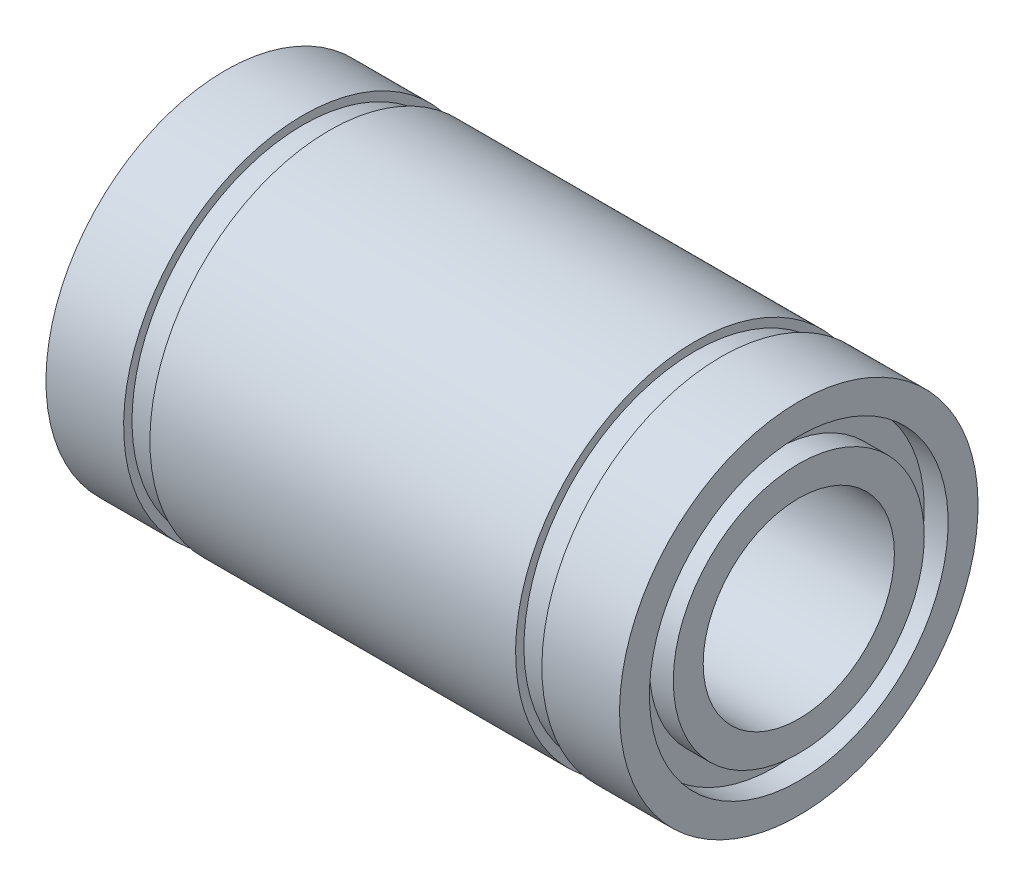
ISO-10303-21;
HEADER;
FILE_DESCRIPTION(('STEP AP214'),'2;1');
FILE_NAME('part.step','',(''),(''),'','','');
FILE_SCHEMA(('AUTOMOTIVE_DESIGN { 1 0 10303 214 1 1 1 1 }'));
ENDSEC;
DATA;
#1=APPLICATION_CONTEXT('core data for automotive mechanical design processes');
#2=APPLICATION_PROTOCOL_DEFINITION('international standard','automotive_design',2000,#1);
#3=PRODUCT_CONTEXT('',#1,'mechanical');
#4=PRODUCT('Part','Part','',(#3));
#5=PRODUCT_RELATED_PRODUCT_CATEGORY('part','',(#4));
#6=PRODUCT_DEFINITION_FORMATION('','',#4);
#7=PRODUCT_DEFINITION_CONTEXT('part definition',#1,'design');
#8=PRODUCT_DEFINITION('design','',#6,#7);
#9=PRODUCT_DEFINITION_SHAPE('','',#8);
#10=(LENGTH_UNIT() NAMED_UNIT(*) SI_UNIT(.MILLI.,.METRE.));
#11=(NAMED_UNIT(*) PLANE_ANGLE_UNIT() SI_UNIT($,.RADIAN.));
#12=(NAMED_UNIT(*) SI_UNIT($,.STERADIAN.) SOLID_ANGLE_UNIT());
#13=UNCERTAINTY_MEASURE_WITH_UNIT(LENGTH_MEASURE(1.E-05),#10,'distance_accuracy_value','');
#14=(GEOMETRIC_REPRESENTATION_CONTEXT(3) GLOBAL_UNCERTAINTY_ASSIGNED_CONTEXT((#13)) GLOBAL_UNIT_ASSIGNED_CONTEXT((#10,
#11,#12)) REPRESENTATION_CONTEXT('',''));
#15=CARTESIAN_POINT('',(0.,0.,0.));
#16=DIRECTION('',(0.,0.,1.));
#17=DIRECTION('',(1.,0.,0.));
#18=AXIS2_PLACEMENT_3D('',#15,#16,#17);
#19=CARTESIAN_POINT('',(-12.,6.25,0.));
#20=DIRECTION('',(-1.,0.,0.));
#21=DIRECTION('',(0.,-1.,0.));
#22=AXIS2_PLACEMENT_3D('',#19,#20,#21);
#23=PLANE('',#22);
#24=CARTESIAN_POINT('',(-12.,0.,0.));
#25=DIRECTION('',(1.,0.,0.));
#26=DIRECTION('',(0.,1.,0.));
#27=AXIS2_PLACEMENT_3D('',#24,#25,#26);
#28=CIRCLE('',#27,6.25);
#29=CARTESIAN_POINT('',(-12.,6.25,0.));
#30=VERTEX_POINT('',#29);
#31=EDGE_CURVE('E98',#30,#30,#28,.T.);
#32=ORIENTED_EDGE('',*,*,#31,.T.);
#33=EDGE_LOOP('',(#32));
#34=FACE_BOUND('',#33,.T.);
#35=CARTESIAN_POINT('',(-12.,0.,0.));
#36=DIRECTION('',(1.,0.,0.));
#37=DIRECTION('',(0.,1.,0.));
#38=AXIS2_PLACEMENT_3D('',#35,#36,#37);
#39=CIRCLE('',#38,7.5);
#40=CARTESIAN_POINT('',(-12.,7.5,0.));
#41=VERTEX_POINT('',#40);
#42=EDGE_CURVE('E10',#41,#41,#39,.T.);
#43=ORIENTED_EDGE('',*,*,#42,.F.);
#44=EDGE_LOOP('',(#43));
#45=FACE_BOUND('',#44,.T.);
#46=ADVANCED_FACE('F34',(#34,#45),#23,.T.);
#47=CARTESIAN_POINT('',(0.,0.,0.));
#48=DIRECTION('',(1.,0.,0.));
#49=DIRECTION('',(0.,1.,0.));
#50=AXIS2_PLACEMENT_3D('',#47,#48,#49);
#51=CYLINDRICAL_SURFACE('',#50,7.50000000000001);
#52=ORIENTED_EDGE('',*,*,#42,.T.);
#53=EDGE_LOOP('',(#52));
#54=FACE_BOUND('',#53,.T.);
#55=CARTESIAN_POINT('',(-8.75,0.,0.));
#56=DIRECTION('',(1.,0.,0.));
#57=DIRECTION('',(0.,1.,0.));
#58=AXIS2_PLACEMENT_3D('',#55,#56,#57);
#59=CIRCLE('',#58,7.50000000000001);
#60=CARTESIAN_POINT('',(-8.75,7.50000000000001,0.));
#61=VERTEX_POINT('',#60);
#62=EDGE_CURVE('E40',#61,#61,#59,.T.);
#63=ORIENTED_EDGE('',*,*,#62,.F.);
#64=EDGE_LOOP('',(#63));
#65=FACE_BOUND('',#64,.T.);
#66=ADVANCED_FACE('F116',(#54,#65),#51,.T.);
#67=CARTESIAN_POINT('',(-8.75,7.50000000000001,0.));
#68=DIRECTION('',(1.,0.,0.));
#69=DIRECTION('',(0.,1.,0.));
#70=AXIS2_PLACEMENT_3D('',#67,#68,#69);
#71=PLANE('',#70);
#72=ORIENTED_EDGE('',*,*,#62,.T.);
#73=EDGE_LOOP('',(#72));
#74=FACE_BOUND('',#73,.T.);
#75=CARTESIAN_POINT('',(-8.75,0.,0.));
#76=DIRECTION('',(1.,0.,0.));
#77=DIRECTION('',(0.,1.,0.));
#78=AXIS2_PLACEMENT_3D('',#75,#76,#77);
#79=CIRCLE('',#78,7.15);
#80=CARTESIAN_POINT('',(-8.75,7.15,0.));
#81=VERTEX_POINT('',#80);
#82=EDGE_CURVE('E44',#81,#81,#79,.T.);
#83=ORIENTED_EDGE('',*,*,#82,.F.);
#84=EDGE_LOOP('',(#83));
#85=FACE_BOUND('',#84,.T.);
#86=ADVANCED_FACE('F120',(#74,#85),#71,.T.);
#87=CARTESIAN_POINT('',(0.,0.,0.));
#88=DIRECTION('',(1.,0.,0.));
#89=DIRECTION('',(0.,1.,0.));
#90=AXIS2_PLACEMENT_3D('',#87,#88,#89);
#91=CYLINDRICAL_SURFACE('',#90,7.15);
#92=ORIENTED_EDGE('',*,*,#82,.T.);
#93=EDGE_LOOP('',(#92));
#94=FACE_BOUND('',#93,.T.);
#95=CARTESIAN_POINT('',(-7.65,0.,0.));
#96=DIRECTION('',(1.,0.,0.));
#97=DIRECTION('',(0.,1.,0.));
#98=AXIS2_PLACEMENT_3D('',#95,#96,#97);
#99=CIRCLE('',#98,7.15);
#100=CARTESIAN_POINT('',(-7.65,7.15,0.));
#101=VERTEX_POINT('',#100);
#102=EDGE_CURVE('E48',#101,#101,#99,.T.);
#103=ORIENTED_EDGE('',*,*,#102,.F.);
#104=EDGE_LOOP('',(#103));
#105=FACE_BOUND('',#104,.T.);
#106=ADVANCED_FACE('F124',(#94,#105),#91,.T.);
#107=CARTESIAN_POINT('',(-7.65,7.15,0.));
#108=DIRECTION('',(-1.,0.,0.));
#109=DIRECTION('',(0.,-1.,0.));
#110=AXIS2_PLACEMENT_3D('',#107,#108,#109);
#111=PLANE('',#110);
#112=ORIENTED_EDGE('',*,*,#102,.T.);
#113=EDGE_LOOP('',(#112));
#114=FACE_BOUND('',#113,.T.);
#115=CARTESIAN_POINT('',(-7.65,0.,0.));
#116=DIRECTION('',(1.,0.,0.));
#117=DIRECTION('',(0.,1.,0.));
#118=AXIS2_PLACEMENT_3D('',#115,#116,#117);
#119=CIRCLE('',#118,7.50000000000001);
#120=CARTESIAN_POINT('',(-7.65,7.50000000000001,0.));
#121=VERTEX_POINT('',#120);
#122=EDGE_CURVE('E53',#121,#121,#119,.T.);
#123=ORIENTED_EDGE('',*,*,#122,.F.);
#124=EDGE_LOOP('',(#123));
#125=FACE_BOUND('',#124,.T.);
#126=ADVANCED_FACE('F130',(#114,#125),#111,.T.);
#127=CARTESIAN_POINT('',(0.,0.,0.));
#128=DIRECTION('',(1.,0.,0.));
#129=DIRECTION('',(0.,1.,0.));
#130=AXIS2_PLACEMENT_3D('',#127,#128,#129);
#131=CYLINDRICAL_SURFACE('',#130,7.50000000000001);
#132=ORIENTED_EDGE('',*,*,#122,.T.);
#133=EDGE_LOOP('',(#132));
#134=FACE_BOUND('',#133,.T.);
#135=CARTESIAN_POINT('',(7.65,0.,0.));
#136=DIRECTION('',(1.,0.,0.));
#137=DIRECTION('',(0.,1.,0.));
#138=AXIS2_PLACEMENT_3D('',#135,#136,#137);
#139=CIRCLE('',#138,7.50000000000001);
#140=CARTESIAN_POINT('',(7.65,7.50000000000001,0.));
#141=VERTEX_POINT('',#140);
#142=EDGE_CURVE('E56',#141,#141,#139,.T.);
#143=ORIENTED_EDGE('',*,*,#142,.F.);
#144=EDGE_LOOP('',(#143));
#145=FACE_BOUND('',#144,.T.);
#146=ADVANCED_FACE('F134',(#134,#145),#131,.T.);
#147=CARTESIAN_POINT('',(7.65,7.50000000000001,0.));
#148=DIRECTION('',(1.,0.,0.));
#149=DIRECTION('',(0.,1.,0.));
#150=AXIS2_PLACEMENT_3D('',#147,#148,#149);
#151=PLANE('',#150);
#152=ORIENTED_EDGE('',*,*,#142,.T.);
#153=EDGE_LOOP('',(#152));
#154=FACE_BOUND('',#153,.T.);
#155=CARTESIAN_POINT('',(7.65,0.,0.));
#156=DIRECTION('',(1.,0.,0.));
#157=DIRECTION('',(0.,1.,0.));
#158=AXIS2_PLACEMENT_3D('',#155,#156,#157);
#159=CIRCLE('',#158,7.15);
#160=CARTESIAN_POINT('',(7.65,7.15,0.));
#161=VERTEX_POINT('',#160);
#162=EDGE_CURVE('E59',#161,#161,#159,.T.);
#163=ORIENTED_EDGE('',*,*,#162,.F.);
#164=EDGE_LOOP('',(#163));
#165=FACE_BOUND('',#164,.T.);
#166=ADVANCED_FACE('F138',(#154,#165),#151,.T.);
#167=CARTESIAN_POINT('',(0.,0.,0.));
#168=DIRECTION('',(1.,0.,0.));
#169=DIRECTION('',(0.,1.,0.));
#170=AXIS2_PLACEMENT_3D('',#167,#168,#169);
#171=CYLINDRICAL_SURFACE('',#170,7.15);
#172=ORIENTED_EDGE('',*,*,#162,.T.);
#173=EDGE_LOOP('',(#172));
#174=FACE_BOUND('',#173,.T.);
#175=CARTESIAN_POINT('',(8.75000000000001,0.,0.));
#176=DIRECTION('',(1.,0.,0.));
#177=DIRECTION('',(0.,1.,0.));
#178=AXIS2_PLACEMENT_3D('',#175,#176,#177);
#179=CIRCLE('',#178,7.15);
#180=CARTESIAN_POINT('',(8.75000000000001,7.15,0.));
#181=VERTEX_POINT('',#180);
#182=EDGE_CURVE('E62',#181,#181,#179,.T.);
#183=ORIENTED_EDGE('',*,*,#182,.F.);
#184=EDGE_LOOP('',(#183));
#185=FACE_BOUND('',#184,.T.);
#186=ADVANCED_FACE('F142',(#174,#185),#171,.T.);
#187=CARTESIAN_POINT('',(8.75000000000001,7.15,0.));
#188=DIRECTION('',(-1.,0.,0.));
#189=DIRECTION('',(0.,-1.,0.));
#190=AXIS2_PLACEMENT_3D('',#187,#188,#189);
#191=PLANE('',#190);
#192=ORIENTED_EDGE('',*,*,#182,.T.);
#193=EDGE_LOOP('',(#192));
#194=FACE_BOUND('',#193,.T.);
#195=CARTESIAN_POINT('',(8.75000000000001,0.,0.));
#196=DIRECTION('',(1.,0.,0.));
#197=DIRECTION('',(0.,1.,0.));
#198=AXIS2_PLACEMENT_3D('',#195,#196,#197);
#199=CIRCLE('',#198,7.50000000000001);
#200=CARTESIAN_POINT('',(8.75000000000001,7.50000000000001,0.));
#201=VERTEX_POINT('',#200);
#202=EDGE_CURVE('E65',#201,#201,#199,.T.);
#203=ORIENTED_EDGE('',*,*,#202,.F.);
#204=EDGE_LOOP('',(#203));
#205=FACE_BOUND('',#204,.T.);
#206=ADVANCED_FACE('F146',(#194,#205),#191,.T.);
#207=CARTESIAN_POINT('',(0.,0.,0.));
#208=DIRECTION('',(1.,0.,0.));
#209=DIRECTION('',(0.,1.,0.));
#210=AXIS2_PLACEMENT_3D('',#207,#208,#209);
#211=CYLINDRICAL_SURFACE('',#210,7.49999999999998);
#212=ORIENTED_EDGE('',*,*,#202,.T.);
#213=EDGE_LOOP('',(#212));
#214=FACE_BOUND('',#213,.T.);
#215=CARTESIAN_POINT('',(12.,0.,0.));
#216=DIRECTION('',(1.,0.,0.));
#217=DIRECTION('',(0.,1.,0.));
#218=AXIS2_PLACEMENT_3D('',#215,#216,#217);
#219=CIRCLE('',#218,7.49999999999995);
#220=CARTESIAN_POINT('',(12.,7.49999999999995,0.));
#221=VERTEX_POINT('',#220);
#222=EDGE_CURVE('E68',#221,#221,#219,.T.);
#223=ORIENTED_EDGE('',*,*,#222,.F.);
#224=EDGE_LOOP('',(#223));
#225=FACE_BOUND('',#224,.T.);
#226=ADVANCED_FACE('F150',(#214,#225),#211,.T.);
#227=CARTESIAN_POINT('',(12.,7.49999999999995,0.));
#228=DIRECTION('',(1.,0.,0.));
#229=DIRECTION('',(0.,1.,0.));
#230=AXIS2_PLACEMENT_3D('',#227,#228,#229);
#231=PLANE('',#230);
#232=ORIENTED_EDGE('',*,*,#222,.T.);
#233=EDGE_LOOP('',(#232));
#234=FACE_BOUND('',#233,.T.);
#235=CARTESIAN_POINT('',(12.0000000000001,0.,0.));
#236=DIRECTION('',(1.,0.,0.));
#237=DIRECTION('',(0.,1.,0.));
#238=AXIS2_PLACEMENT_3D('',#235,#236,#237);
#239=CIRCLE('',#238,6.24999999999998);
#240=CARTESIAN_POINT('',(12.0000000000001,6.24999999999998,0.));
#241=VERTEX_POINT('',#240);
#242=EDGE_CURVE('E71',#241,#241,#239,.T.);
#243=ORIENTED_EDGE('',*,*,#242,.F.);
#244=EDGE_LOOP('',(#243));
#245=FACE_BOUND('',#244,.T.);
#246=ADVANCED_FACE('F154',(#234,#245),#231,.T.);
#247=CARTESIAN_POINT('',(0.,0.,0.));
#248=DIRECTION('',(1.,0.,0.));
#249=DIRECTION('',(0.,1.,0.));
#250=AXIS2_PLACEMENT_3D('',#247,#248,#249);
#251=CYLINDRICAL_SURFACE('',#250,6.24999999999997);
#252=ORIENTED_EDGE('',*,*,#242,.T.);
#253=EDGE_LOOP('',(#252));
#254=FACE_BOUND('',#253,.T.);
#255=CARTESIAN_POINT('',(11.0000000000001,0.,0.));
#256=DIRECTION('',(1.,0.,0.));
#257=DIRECTION('',(0.,1.,0.));
#258=AXIS2_PLACEMENT_3D('',#255,#256,#257);
#259=CIRCLE('',#258,6.24999999999997);
#260=CARTESIAN_POINT('',(11.0000000000001,6.24999999999997,0.));
#261=VERTEX_POINT('',#260);
#262=EDGE_CURVE('E74',#261,#261,#259,.T.);
#263=ORIENTED_EDGE('',*,*,#262,.F.);
#264=EDGE_LOOP('',(#263));
#265=FACE_BOUND('',#264,.T.);
#266=ADVANCED_FACE('F158',(#254,#265),#251,.F.);
#267=CARTESIAN_POINT('',(11.0000000000001,6.24999999999997,0.));
#268=DIRECTION('',(1.,0.,0.));
#269=DIRECTION('',(0.,1.,0.));
#270=AXIS2_PLACEMENT_3D('',#267,#268,#269);
#271=PLANE('',#270);
#272=ORIENTED_EDGE('',*,*,#262,.T.);
#273=EDGE_LOOP('',(#272));
#274=FACE_BOUND('',#273,.T.);
#275=CARTESIAN_POINT('',(11.0000000000001,0.,0.));
#276=DIRECTION('',(1.,0.,0.));
#277=DIRECTION('',(0.,1.,0.));
#278=AXIS2_PLACEMENT_3D('',#275,#276,#277);
#279=CIRCLE('',#278,5.24999999999997);
#280=CARTESIAN_POINT('',(11.0000000000001,5.24999999999997,0.));
#281=VERTEX_POINT('',#280);
#282=EDGE_CURVE('E77',#281,#281,#279,.T.);
#283=ORIENTED_EDGE('',*,*,#282,.F.);
#284=EDGE_LOOP('',(#283));
#285=FACE_BOUND('',#284,.T.);
#286=ADVANCED_FACE('F162',(#274,#285),#271,.T.);
#287=CARTESIAN_POINT('',(0.,0.,0.));
#288=DIRECTION('',(1.,0.,0.));
#289=DIRECTION('',(0.,1.,0.));
#290=AXIS2_PLACEMENT_3D('',#287,#288,#289);
#291=CYLINDRICAL_SURFACE('',#290,5.24999999999997);
#292=ORIENTED_EDGE('',*,*,#282,.T.);
#293=EDGE_LOOP('',(#292));
#294=FACE_BOUND('',#293,.T.);
#295=CARTESIAN_POINT('',(12.0000000000001,0.,0.));
#296=DIRECTION('',(1.,0.,0.));
#297=DIRECTION('',(0.,1.,0.));
#298=AXIS2_PLACEMENT_3D('',#295,#296,#297);
#299=CIRCLE('',#298,5.24999999999998);
#300=CARTESIAN_POINT('',(12.0000000000001,5.24999999999998,0.));
#301=VERTEX_POINT('',#300);
#302=EDGE_CURVE('E80',#301,#301,#299,.T.);
#303=ORIENTED_EDGE('',*,*,#302,.F.);
#304=EDGE_LOOP('',(#303));
#305=FACE_BOUND('',#304,.T.);
#306=ADVANCED_FACE('F166',(#294,#305),#291,.T.);
#307=CARTESIAN_POINT('',(12.0000000000001,5.24999999999998,0.));
#308=DIRECTION('',(1.,0.,0.));
#309=DIRECTION('',(0.,1.,0.));
#310=AXIS2_PLACEMENT_3D('',#307,#308,#309);
#311=PLANE('',#310);
#312=ORIENTED_EDGE('',*,*,#302,.T.);
#313=EDGE_LOOP('',(#312));
#314=FACE_BOUND('',#313,.T.);
#315=CARTESIAN_POINT('',(12.0000000000001,0.,0.));
#316=DIRECTION('',(1.,0.,0.));
#317=DIRECTION('',(0.,1.,0.));
#318=AXIS2_PLACEMENT_3D('',#315,#316,#317);
#319=CIRCLE('',#318,3.99999999999999);
#320=CARTESIAN_POINT('',(12.0000000000001,4.,0.));
#321=VERTEX_POINT('',#320);
#322=EDGE_CURVE('E83',#321,#321,#319,.T.);
#323=ORIENTED_EDGE('',*,*,#322,.F.);
#324=EDGE_LOOP('',(#323));
#325=FACE_BOUND('',#324,.T.);
#326=ADVANCED_FACE('F170',(#314,#325),#311,.T.);
#327=CARTESIAN_POINT('',(0.,0.,0.));
#328=DIRECTION('',(1.,0.,0.));
#329=DIRECTION('',(0.,1.,0.));
#330=AXIS2_PLACEMENT_3D('',#327,#328,#329);
#331=CYLINDRICAL_SURFACE('',#330,4.);
#332=ORIENTED_EDGE('',*,*,#322,.T.);
#333=EDGE_LOOP('',(#332));
#334=FACE_BOUND('',#333,.T.);
#335=CARTESIAN_POINT('',(-12.,0.,0.));
#336=DIRECTION('',(1.,0.,0.));
#337=DIRECTION('',(0.,1.,0.));
#338=AXIS2_PLACEMENT_3D('',#335,#336,#337);
#339=CIRCLE('',#338,4.);
#340=CARTESIAN_POINT('',(-12.,4.,0.));
#341=VERTEX_POINT('',#340);
#342=EDGE_CURVE('E86',#341,#341,#339,.T.);
#343=ORIENTED_EDGE('',*,*,#342,.F.);
#344=EDGE_LOOP('',(#343));
#345=FACE_BOUND('',#344,.T.);
#346=ADVANCED_FACE('F174',(#334,#345),#331,.F.);
#347=CARTESIAN_POINT('',(-12.,4.,0.));
#348=DIRECTION('',(-1.,0.,0.));
#349=DIRECTION('',(0.,-1.,0.));
#350=AXIS2_PLACEMENT_3D('',#347,#348,#349);
#351=PLANE('',#350);
#352=ORIENTED_EDGE('',*,*,#342,.T.);
#353=EDGE_LOOP('',(#352));
#354=FACE_BOUND('',#353,.T.);
#355=CARTESIAN_POINT('',(-12.,0.,0.));
#356=DIRECTION('',(1.,0.,0.));
#357=DIRECTION('',(0.,1.,0.));
#358=AXIS2_PLACEMENT_3D('',#355,#356,#357);
#359=CIRCLE('',#358,5.25);
#360=CARTESIAN_POINT('',(-12.,5.25,0.));
#361=VERTEX_POINT('',#360);
#362=EDGE_CURVE('E89',#361,#361,#359,.T.);
#363=ORIENTED_EDGE('',*,*,#362,.F.);
#364=EDGE_LOOP('',(#363));
#365=FACE_BOUND('',#364,.T.);
#366=ADVANCED_FACE('F178',(#354,#365),#351,.T.);
#367=CARTESIAN_POINT('',(0.,0.,0.));
#368=DIRECTION('',(1.,0.,0.));
#369=DIRECTION('',(0.,1.,0.));
#370=AXIS2_PLACEMENT_3D('',#367,#368,#369);
#371=CYLINDRICAL_SURFACE('',#370,5.25);
#372=ORIENTED_EDGE('',*,*,#362,.T.);
#373=EDGE_LOOP('',(#372));
#374=FACE_BOUND('',#373,.T.);
#375=CARTESIAN_POINT('',(-11.,0.,0.));
#376=DIRECTION('',(1.,0.,0.));
#377=DIRECTION('',(0.,1.,0.));
#378=AXIS2_PLACEMENT_3D('',#375,#376,#377);
#379=CIRCLE('',#378,5.25);
#380=CARTESIAN_POINT('',(-11.,5.25,0.));
#381=VERTEX_POINT('',#380);
#382=EDGE_CURVE('E92',#381,#381,#379,.T.);
#383=ORIENTED_EDGE('',*,*,#382,.F.);
#384=EDGE_LOOP('',(#383));
#385=FACE_BOUND('',#384,.T.);
#386=ADVANCED_FACE('F112',(#374,#385),#371,.T.);
#387=CARTESIAN_POINT('',(-11.,6.25,0.));
#388=DIRECTION('',(-1.,0.,0.));
#389=DIRECTION('',(0.,-1.,0.));
#390=AXIS2_PLACEMENT_3D('',#387,#388,#389);
#391=PLANE('',#390);
#392=ORIENTED_EDGE('',*,*,#382,.T.);
#393=EDGE_LOOP('',(#392));
#394=FACE_BOUND('',#393,.T.);
#395=CARTESIAN_POINT('',(-11.,0.,0.));
#396=DIRECTION('',(1.,0.,0.));
#397=DIRECTION('',(0.,1.,0.));
#398=AXIS2_PLACEMENT_3D('',#395,#396,#397);
#399=CIRCLE('',#398,6.25);
#400=CARTESIAN_POINT('',(-11.,6.25,0.));
#401=VERTEX_POINT('',#400);
#402=EDGE_CURVE('E95',#401,#401,#399,.T.);
#403=ORIENTED_EDGE('',*,*,#402,.F.);
#404=EDGE_LOOP('',(#403));
#405=FACE_BOUND('',#404,.T.);
#406=ADVANCED_FACE('F106',(#394,#405),#391,.T.);
#407=CARTESIAN_POINT('',(0.,0.,0.));
#408=DIRECTION('',(1.,0.,0.));
#409=DIRECTION('',(0.,1.,0.));
#410=AXIS2_PLACEMENT_3D('',#407,#408,#409);
#411=CYLINDRICAL_SURFACE('',#410,6.25);
#412=ORIENTED_EDGE('',*,*,#402,.T.);
#413=EDGE_LOOP('',(#412));
#414=FACE_BOUND('',#413,.T.);
#415=ORIENTED_EDGE('',*,*,#31,.F.);
#416=EDGE_LOOP('',(#415));
#417=FACE_BOUND('',#416,.T.);
#418=ADVANCED_FACE('F104',(#414,#417),#411,.F.);
#419=CLOSED_SHELL('',(#46,#66,#86,#106,#126,#146,#166,#186,#206,#226,#246,#266,#286,#306,#326,
#346,#366,#386,#406,#418));
#420=MANIFOLD_SOLID_BREP('B2',#419);
#421=ADVANCED_BREP_SHAPE_REPRESENTATION('',(#18,#420),#14);
#422=SHAPE_DEFINITION_REPRESENTATION(#9,#421);
ENDSEC;
END-ISO-10303-21;
